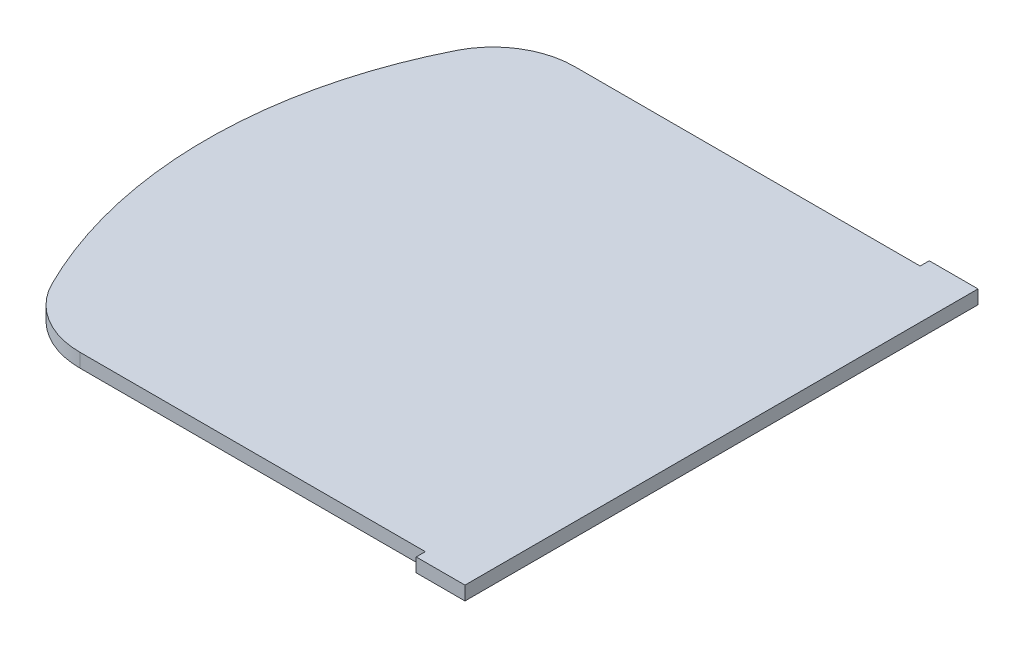
ISO-10303-21;
HEADER;
FILE_DESCRIPTION(('STEP AP214'),'2;1');
FILE_NAME('part.step','',(''),(''),'','','');
FILE_SCHEMA(('AUTOMOTIVE_DESIGN { 1 0 10303 214 1 1 1 1 }'));
ENDSEC;
DATA;
#1=APPLICATION_CONTEXT('core data for automotive mechanical design processes');
#2=APPLICATION_PROTOCOL_DEFINITION('international standard','automotive_design',2000,#1);
#3=PRODUCT_CONTEXT('',#1,'mechanical');
#4=PRODUCT('Part','Part','',(#3));
#5=PRODUCT_RELATED_PRODUCT_CATEGORY('part','',(#4));
#6=PRODUCT_DEFINITION_FORMATION('','',#4);
#7=PRODUCT_DEFINITION_CONTEXT('part definition',#1,'design');
#8=PRODUCT_DEFINITION('design','',#6,#7);
#9=PRODUCT_DEFINITION_SHAPE('','',#8);
#10=(LENGTH_UNIT() NAMED_UNIT(*) SI_UNIT(.MILLI.,.METRE.));
#11=(NAMED_UNIT(*) PLANE_ANGLE_UNIT() SI_UNIT($,.RADIAN.));
#12=(NAMED_UNIT(*) SI_UNIT($,.STERADIAN.) SOLID_ANGLE_UNIT());
#13=UNCERTAINTY_MEASURE_WITH_UNIT(LENGTH_MEASURE(1.E-05),#10,'distance_accuracy_value','');
#14=(GEOMETRIC_REPRESENTATION_CONTEXT(3) GLOBAL_UNCERTAINTY_ASSIGNED_CONTEXT((#13)) GLOBAL_UNIT_ASSIGNED_CONTEXT((#10,
#11,#12)) REPRESENTATION_CONTEXT('',''));
#15=CARTESIAN_POINT('',(0.,0.,0.));
#16=DIRECTION('',(0.,0.,1.));
#17=DIRECTION('',(1.,0.,0.));
#18=AXIS2_PLACEMENT_3D('',#15,#16,#17);
#19=CARTESIAN_POINT('',(0.,6.5,-242.));
#20=DIRECTION('',(0.,0.,1.));
#21=DIRECTION('',(1.,0.,0.));
#22=AXIS2_PLACEMENT_3D('',#19,#20,#21);
#23=PLANE('',#22);
#24=DIRECTION('',(-1.,0.,0.));
#25=VECTOR('',#24,1.);
#26=CARTESIAN_POINT('',(0.,-6.5,-242.));
#27=LINE('',#26,#25);
#28=CARTESIAN_POINT('',(0.,-6.5,-242.));
#29=VERTEX_POINT('',#28);
#30=CARTESIAN_POINT('',(-46.,-6.5,-242.));
#31=VERTEX_POINT('',#30);
#32=EDGE_CURVE('E140',#29,#31,#27,.T.);
#33=ORIENTED_EDGE('',*,*,#32,.T.);
#34=DIRECTION('',(0.,-1.,0.));
#35=VECTOR('',#34,1.);
#36=CARTESIAN_POINT('',(-46.,6.5,-242.));
#37=LINE('',#36,#35);
#38=CARTESIAN_POINT('',(-46.,6.5,-242.));
#39=VERTEX_POINT('',#38);
#40=EDGE_CURVE('E11',#39,#31,#37,.T.);
#41=ORIENTED_EDGE('',*,*,#40,.F.);
#42=DIRECTION('',(-1.,0.,0.));
#43=VECTOR('',#42,1.);
#44=CARTESIAN_POINT('',(0.,6.5,-242.));
#45=LINE('',#44,#43);
#46=CARTESIAN_POINT('',(0.,6.5,-242.));
#47=VERTEX_POINT('',#46);
#48=EDGE_CURVE('E158',#47,#39,#45,.T.);
#49=ORIENTED_EDGE('',*,*,#48,.F.);
#50=DIRECTION('',(0.,-1.,0.));
#51=VECTOR('',#50,1.);
#52=CARTESIAN_POINT('',(0.,6.5,-242.));
#53=LINE('',#52,#51);
#54=EDGE_CURVE('E136',#47,#29,#53,.T.);
#55=ORIENTED_EDGE('',*,*,#54,.T.);
#56=EDGE_LOOP('',(#33,#41,#49,#55));
#57=FACE_BOUND('',#56,.T.);
#58=ADVANCED_FACE('F32',(#57),#23,.F.);
#59=CARTESIAN_POINT('',(-46.,6.5,-242.));
#60=DIRECTION('',(1.,0.,0.));
#61=DIRECTION('',(0.,0.,-1.));
#62=AXIS2_PLACEMENT_3D('',#59,#60,#61);
#63=PLANE('',#62);
#64=DIRECTION('',(0.,0.,1.));
#65=VECTOR('',#64,1.);
#66=CARTESIAN_POINT('',(-46.,-6.5,-242.));
#67=LINE('',#66,#65);
#68=CARTESIAN_POINT('',(-46.,-6.5,-233.387339641034));
#69=VERTEX_POINT('',#68);
#70=EDGE_CURVE('E143',#31,#69,#67,.T.);
#71=ORIENTED_EDGE('',*,*,#70,.T.);
#72=DIRECTION('',(0.,-1.,0.));
#73=VECTOR('',#72,1.);
#74=CARTESIAN_POINT('',(-46.,6.5,-233.387339641034));
#75=LINE('',#74,#73);
#76=CARTESIAN_POINT('',(-46.,6.5,-233.387339641034));
#77=VERTEX_POINT('',#76);
#78=EDGE_CURVE('E40',#77,#69,#75,.T.);
#79=ORIENTED_EDGE('',*,*,#78,.F.);
#80=DIRECTION('',(0.,0.,1.));
#81=VECTOR('',#80,1.);
#82=CARTESIAN_POINT('',(-46.,6.5,-242.));
#83=LINE('',#82,#81);
#84=EDGE_CURVE('E97',#39,#77,#83,.T.);
#85=ORIENTED_EDGE('',*,*,#84,.F.);
#86=ORIENTED_EDGE('',*,*,#40,.T.);
#87=EDGE_LOOP('',(#71,#79,#85,#86));
#88=FACE_BOUND('',#87,.T.);
#89=ADVANCED_FACE('F207',(#88),#63,.F.);
#90=CARTESIAN_POINT('',(-46.,6.5,-233.387339641034));
#91=DIRECTION('',(0.,0.,1.));
#92=DIRECTION('',(1.,0.,0.));
#93=AXIS2_PLACEMENT_3D('',#90,#91,#92);
#94=PLANE('',#93);
#95=DIRECTION('',(-1.,0.,0.));
#96=VECTOR('',#95,1.);
#97=CARTESIAN_POINT('',(-46.,-6.5,-233.387339641034));
#98=LINE('',#97,#96);
#99=CARTESIAN_POINT('',(-372.,-6.5,-233.387339641033));
#100=VERTEX_POINT('',#99);
#101=EDGE_CURVE('E145',#69,#100,#98,.T.);
#102=ORIENTED_EDGE('',*,*,#101,.T.);
#103=DIRECTION('',(0.,-1.,0.));
#104=VECTOR('',#103,1.);
#105=CARTESIAN_POINT('',(-372.,6.5,-233.387339641033));
#106=LINE('',#105,#104);
#107=CARTESIAN_POINT('',(-372.,6.5,-233.387339641033));
#108=VERTEX_POINT('',#107);
#109=EDGE_CURVE('E171',#108,#100,#106,.T.);
#110=ORIENTED_EDGE('',*,*,#109,.F.);
#111=DIRECTION('',(-1.,0.,0.));
#112=VECTOR('',#111,1.);
#113=CARTESIAN_POINT('',(-46.,6.5,-233.387339641034));
#114=LINE('',#113,#112);
#115=EDGE_CURVE('E179',#77,#108,#114,.T.);
#116=ORIENTED_EDGE('',*,*,#115,.F.);
#117=ORIENTED_EDGE('',*,*,#78,.T.);
#118=EDGE_LOOP('',(#102,#110,#116,#117));
#119=FACE_BOUND('',#118,.T.);
#120=ADVANCED_FACE('F177',(#119),#94,.F.);
#121=CARTESIAN_POINT('',(-372.,6.5,-156.387339641034));
#122=DIRECTION('',(0.,-1.,0.));
#123=DIRECTION('',(0.,0.,-1.));
#124=AXIS2_PLACEMENT_3D('',#121,#122,#123);
#125=CYLINDRICAL_SURFACE('',#124,77.);
#126=CARTESIAN_POINT('',(-372.,-6.5,-156.387339641034));
#127=DIRECTION('',(0.,1.,0.));
#128=DIRECTION('',(0.,0.,1.));
#129=AXIS2_PLACEMENT_3D('',#126,#127,#128);
#130=CIRCLE('',#129,77.);
#131=CARTESIAN_POINT('',(-440.836676217765,-6.5,-190.891136639199));
#132=VERTEX_POINT('',#131);
#133=EDGE_CURVE('E147',#100,#132,#130,.T.);
#134=ORIENTED_EDGE('',*,*,#133,.T.);
#135=DIRECTION('',(0.,-1.,0.));
#136=VECTOR('',#135,1.);
#137=CARTESIAN_POINT('',(-440.836676217765,6.5,-190.891136639199));
#138=LINE('',#137,#136);
#139=CARTESIAN_POINT('',(-440.836676217765,6.5,-190.891136639199));
#140=VERTEX_POINT('',#139);
#141=EDGE_CURVE('E168',#140,#132,#138,.T.);
#142=ORIENTED_EDGE('',*,*,#141,.F.);
#143=CARTESIAN_POINT('',(-372.,6.5,-156.387339641034));
#144=DIRECTION('',(0.,1.,0.));
#145=DIRECTION('',(0.,0.,1.));
#146=AXIS2_PLACEMENT_3D('',#143,#144,#145);
#147=CIRCLE('',#146,77.);
#148=EDGE_CURVE('E197',#108,#140,#147,.T.);
#149=ORIENTED_EDGE('',*,*,#148,.F.);
#150=ORIENTED_EDGE('',*,*,#109,.T.);
#151=EDGE_LOOP('',(#134,#142,#149,#150));
#152=FACE_BOUND('',#151,.T.);
#153=ADVANCED_FACE('F188',(#152),#125,.T.);
#154=CARTESIAN_POINT('',(-60.,6.5,0.));
#155=DIRECTION('',(0.,-1.,0.));
#156=DIRECTION('',(0.,0.,-1.));
#157=AXIS2_PLACEMENT_3D('',#154,#155,#156);
#158=CYLINDRICAL_SURFACE('',#157,426.);
#159=CARTESIAN_POINT('',(-60.,-6.5,0.));
#160=DIRECTION('',(0.,1.,0.));
#161=DIRECTION('',(0.,0.,1.));
#162=AXIS2_PLACEMENT_3D('',#159,#160,#161);
#163=CIRCLE('',#162,426.);
#164=CARTESIAN_POINT('',(-440.836676217765,-6.5,190.891136639199));
#165=VERTEX_POINT('',#164);
#166=EDGE_CURVE('E149',#132,#165,#163,.T.);
#167=ORIENTED_EDGE('',*,*,#166,.T.);
#168=DIRECTION('',(0.,-1.,0.));
#169=VECTOR('',#168,1.);
#170=CARTESIAN_POINT('',(-440.836676217765,6.5,190.891136639199));
#171=LINE('',#170,#169);
#172=CARTESIAN_POINT('',(-440.836676217765,6.5,190.891136639199));
#173=VERTEX_POINT('',#172);
#174=EDGE_CURVE('E165',#173,#165,#171,.T.);
#175=ORIENTED_EDGE('',*,*,#174,.F.);
#176=CARTESIAN_POINT('',(-60.,6.5,0.));
#177=DIRECTION('',(0.,1.,0.));
#178=DIRECTION('',(0.,0.,1.));
#179=AXIS2_PLACEMENT_3D('',#176,#177,#178);
#180=CIRCLE('',#179,426.);
#181=EDGE_CURVE('E194',#140,#173,#180,.T.);
#182=ORIENTED_EDGE('',*,*,#181,.F.);
#183=ORIENTED_EDGE('',*,*,#141,.T.);
#184=EDGE_LOOP('',(#167,#175,#182,#183));
#185=FACE_BOUND('',#184,.T.);
#186=ADVANCED_FACE('F192',(#185),#158,.T.);
#187=CARTESIAN_POINT('',(-372.,6.5,156.387339641034));
#188=DIRECTION('',(0.,-1.,0.));
#189=DIRECTION('',(0.,0.,-1.));
#190=AXIS2_PLACEMENT_3D('',#187,#188,#189);
#191=CYLINDRICAL_SURFACE('',#190,77.);
#192=CARTESIAN_POINT('',(-372.,-6.5,156.387339641034));
#193=DIRECTION('',(0.,1.,0.));
#194=DIRECTION('',(0.,0.,-1.));
#195=AXIS2_PLACEMENT_3D('',#192,#193,#194);
#196=CIRCLE('',#195,77.);
#197=CARTESIAN_POINT('',(-372.,-6.5,233.387339641034));
#198=VERTEX_POINT('',#197);
#199=EDGE_CURVE('E151',#165,#198,#196,.T.);
#200=ORIENTED_EDGE('',*,*,#199,.T.);
#201=DIRECTION('',(0.,-1.,0.));
#202=VECTOR('',#201,1.);
#203=CARTESIAN_POINT('',(-372.,6.5,233.387339641034));
#204=LINE('',#203,#202);
#205=CARTESIAN_POINT('',(-372.,6.5,233.387339641034));
#206=VERTEX_POINT('',#205);
#207=EDGE_CURVE('E162',#206,#198,#204,.T.);
#208=ORIENTED_EDGE('',*,*,#207,.F.);
#209=CARTESIAN_POINT('',(-372.,6.5,156.387339641034));
#210=DIRECTION('',(0.,1.,0.));
#211=DIRECTION('',(0.,0.,-1.));
#212=AXIS2_PLACEMENT_3D('',#209,#210,#211);
#213=CIRCLE('',#212,77.);
#214=EDGE_CURVE('E196',#173,#206,#213,.T.);
#215=ORIENTED_EDGE('',*,*,#214,.F.);
#216=ORIENTED_EDGE('',*,*,#174,.T.);
#217=EDGE_LOOP('',(#200,#208,#215,#216));
#218=FACE_BOUND('',#217,.T.);
#219=ADVANCED_FACE('F219',(#218),#191,.T.);
#220=CARTESIAN_POINT('',(-46.,6.5,233.387339641034));
#221=DIRECTION('',(0.,0.,-1.));
#222=DIRECTION('',(-1.,0.,0.));
#223=AXIS2_PLACEMENT_3D('',#220,#221,#222);
#224=PLANE('',#223);
#225=DIRECTION('',(1.,0.,0.));
#226=VECTOR('',#225,1.);
#227=CARTESIAN_POINT('',(-46.,-6.5,233.387339641034));
#228=LINE('',#227,#226);
#229=CARTESIAN_POINT('',(-46.,-6.5,233.387339641034));
#230=VERTEX_POINT('',#229);
#231=EDGE_CURVE('E153',#198,#230,#228,.T.);
#232=ORIENTED_EDGE('',*,*,#231,.T.);
#233=DIRECTION('',(0.,-1.,0.));
#234=VECTOR('',#233,1.);
#235=CARTESIAN_POINT('',(-46.,6.5,233.387339641034));
#236=LINE('',#235,#234);
#237=CARTESIAN_POINT('',(-46.,6.5,233.387339641034));
#238=VERTEX_POINT('',#237);
#239=EDGE_CURVE('E131',#238,#230,#236,.T.);
#240=ORIENTED_EDGE('',*,*,#239,.F.);
#241=DIRECTION('',(1.,0.,0.));
#242=VECTOR('',#241,1.);
#243=CARTESIAN_POINT('',(-46.,6.5,233.387339641034));
#244=LINE('',#243,#242);
#245=EDGE_CURVE('E122',#206,#238,#244,.T.);
#246=ORIENTED_EDGE('',*,*,#245,.F.);
#247=ORIENTED_EDGE('',*,*,#207,.T.);
#248=EDGE_LOOP('',(#232,#240,#246,#247));
#249=FACE_BOUND('',#248,.T.);
#250=ADVANCED_FACE('F222',(#249),#224,.F.);
#251=CARTESIAN_POINT('',(-46.,6.5,242.));
#252=DIRECTION('',(1.,0.,0.));
#253=DIRECTION('',(0.,0.,-1.));
#254=AXIS2_PLACEMENT_3D('',#251,#252,#253);
#255=PLANE('',#254);
#256=DIRECTION('',(0.,0.,1.));
#257=VECTOR('',#256,1.);
#258=CARTESIAN_POINT('',(-46.,-6.5,242.));
#259=LINE('',#258,#257);
#260=CARTESIAN_POINT('',(-46.,-6.5,242.));
#261=VERTEX_POINT('',#260);
#262=EDGE_CURVE('E130',#230,#261,#259,.T.);
#263=ORIENTED_EDGE('',*,*,#262,.T.);
#264=DIRECTION('',(0.,-1.,0.));
#265=VECTOR('',#264,1.);
#266=CARTESIAN_POINT('',(-46.,6.5,242.));
#267=LINE('',#266,#265);
#268=CARTESIAN_POINT('',(-46.,6.5,242.));
#269=VERTEX_POINT('',#268);
#270=EDGE_CURVE('E127',#269,#261,#267,.T.);
#271=ORIENTED_EDGE('',*,*,#270,.F.);
#272=DIRECTION('',(0.,0.,1.));
#273=VECTOR('',#272,1.);
#274=CARTESIAN_POINT('',(-46.,6.5,242.));
#275=LINE('',#274,#273);
#276=EDGE_CURVE('E116',#238,#269,#275,.T.);
#277=ORIENTED_EDGE('',*,*,#276,.F.);
#278=ORIENTED_EDGE('',*,*,#239,.T.);
#279=EDGE_LOOP('',(#263,#271,#277,#278));
#280=FACE_BOUND('',#279,.T.);
#281=ADVANCED_FACE('F128',(#280),#255,.F.);
#282=CARTESIAN_POINT('',(0.,6.5,242.));
#283=DIRECTION('',(0.,0.,-1.));
#284=DIRECTION('',(-1.,0.,0.));
#285=AXIS2_PLACEMENT_3D('',#282,#283,#284);
#286=PLANE('',#285);
#287=DIRECTION('',(1.,0.,0.));
#288=VECTOR('',#287,1.);
#289=CARTESIAN_POINT('',(0.,-6.5,242.));
#290=LINE('',#289,#288);
#291=CARTESIAN_POINT('',(0.,-6.5,242.));
#292=VERTEX_POINT('',#291);
#293=EDGE_CURVE('E83',#261,#292,#290,.T.);
#294=ORIENTED_EDGE('',*,*,#293,.T.);
#295=DIRECTION('',(0.,-1.,0.));
#296=VECTOR('',#295,1.);
#297=CARTESIAN_POINT('',(0.,6.5,242.));
#298=LINE('',#297,#296);
#299=CARTESIAN_POINT('',(0.,6.5,242.));
#300=VERTEX_POINT('',#299);
#301=EDGE_CURVE('E132',#300,#292,#298,.T.);
#302=ORIENTED_EDGE('',*,*,#301,.F.);
#303=DIRECTION('',(1.,0.,0.));
#304=VECTOR('',#303,1.);
#305=CARTESIAN_POINT('',(0.,6.5,242.));
#306=LINE('',#305,#304);
#307=EDGE_CURVE('E120',#269,#300,#306,.T.);
#308=ORIENTED_EDGE('',*,*,#307,.F.);
#309=ORIENTED_EDGE('',*,*,#270,.T.);
#310=EDGE_LOOP('',(#294,#302,#308,#309));
#311=FACE_BOUND('',#310,.T.);
#312=ADVANCED_FACE('F134',(#311),#286,.F.);
#313=CARTESIAN_POINT('',(0.,6.5,242.));
#314=DIRECTION('',(-1.,0.,0.));
#315=DIRECTION('',(0.,0.,1.));
#316=AXIS2_PLACEMENT_3D('',#313,#314,#315);
#317=PLANE('',#316);
#318=DIRECTION('',(0.,0.,-1.));
#319=VECTOR('',#318,1.);
#320=CARTESIAN_POINT('',(0.,-6.5,242.));
#321=LINE('',#320,#319);
#322=EDGE_CURVE('E89',#292,#29,#321,.T.);
#323=ORIENTED_EDGE('',*,*,#322,.T.);
#324=ORIENTED_EDGE('',*,*,#54,.F.);
#325=DIRECTION('',(0.,0.,-1.));
#326=VECTOR('',#325,1.);
#327=CARTESIAN_POINT('',(0.,6.5,242.));
#328=LINE('',#327,#326);
#329=EDGE_CURVE('E48',#300,#47,#328,.T.);
#330=ORIENTED_EDGE('',*,*,#329,.F.);
#331=ORIENTED_EDGE('',*,*,#301,.T.);
#332=EDGE_LOOP('',(#323,#324,#330,#331));
#333=FACE_BOUND('',#332,.T.);
#334=ADVANCED_FACE('F231',(#333),#317,.F.);
#335=CARTESIAN_POINT('',(-372.,6.5,-156.387339641034));
#336=DIRECTION('',(0.,1.,0.));
#337=DIRECTION('',(0.,0.,1.));
#338=AXIS2_PLACEMENT_3D('',#335,#336,#337);
#339=PLANE('',#338);
#340=ORIENTED_EDGE('',*,*,#48,.T.);
#341=ORIENTED_EDGE('',*,*,#84,.T.);
#342=ORIENTED_EDGE('',*,*,#115,.T.);
#343=ORIENTED_EDGE('',*,*,#148,.T.);
#344=ORIENTED_EDGE('',*,*,#181,.T.);
#345=ORIENTED_EDGE('',*,*,#214,.T.);
#346=ORIENTED_EDGE('',*,*,#245,.T.);
#347=ORIENTED_EDGE('',*,*,#276,.T.);
#348=ORIENTED_EDGE('',*,*,#307,.T.);
#349=ORIENTED_EDGE('',*,*,#329,.T.);
#350=EDGE_LOOP('',(#340,#341,#342,#343,#344,#345,#346,#347,#348,#349));
#351=FACE_BOUND('',#350,.T.);
#352=ADVANCED_FACE('F118',(#351),#339,.T.);
#353=CARTESIAN_POINT('',(-372.,-6.5,-156.387339641034));
#354=DIRECTION('',(0.,1.,0.));
#355=DIRECTION('',(0.,0.,1.));
#356=AXIS2_PLACEMENT_3D('',#353,#354,#355);
#357=PLANE('',#356);
#358=ORIENTED_EDGE('',*,*,#32,.F.);
#359=ORIENTED_EDGE('',*,*,#322,.F.);
#360=ORIENTED_EDGE('',*,*,#293,.F.);
#361=ORIENTED_EDGE('',*,*,#262,.F.);
#362=ORIENTED_EDGE('',*,*,#231,.F.);
#363=ORIENTED_EDGE('',*,*,#199,.F.);
#364=ORIENTED_EDGE('',*,*,#166,.F.);
#365=ORIENTED_EDGE('',*,*,#133,.F.);
#366=ORIENTED_EDGE('',*,*,#101,.F.);
#367=ORIENTED_EDGE('',*,*,#70,.F.);
#368=EDGE_LOOP('',(#358,#359,#360,#361,#362,#363,#364,#365,#366,#367));
#369=FACE_BOUND('',#368,.T.);
#370=ADVANCED_FACE('F183',(#369),#357,.F.);
#371=CLOSED_SHELL('',(#58,#89,#120,#153,#186,#219,#250,#281,#312,#334,#352,#370));
#372=MANIFOLD_SOLID_BREP('B2',#371);
#373=ADVANCED_BREP_SHAPE_REPRESENTATION('',(#18,#372),#14);
#374=SHAPE_DEFINITION_REPRESENTATION(#9,#373);
ENDSEC;
END-ISO-10303-21;
